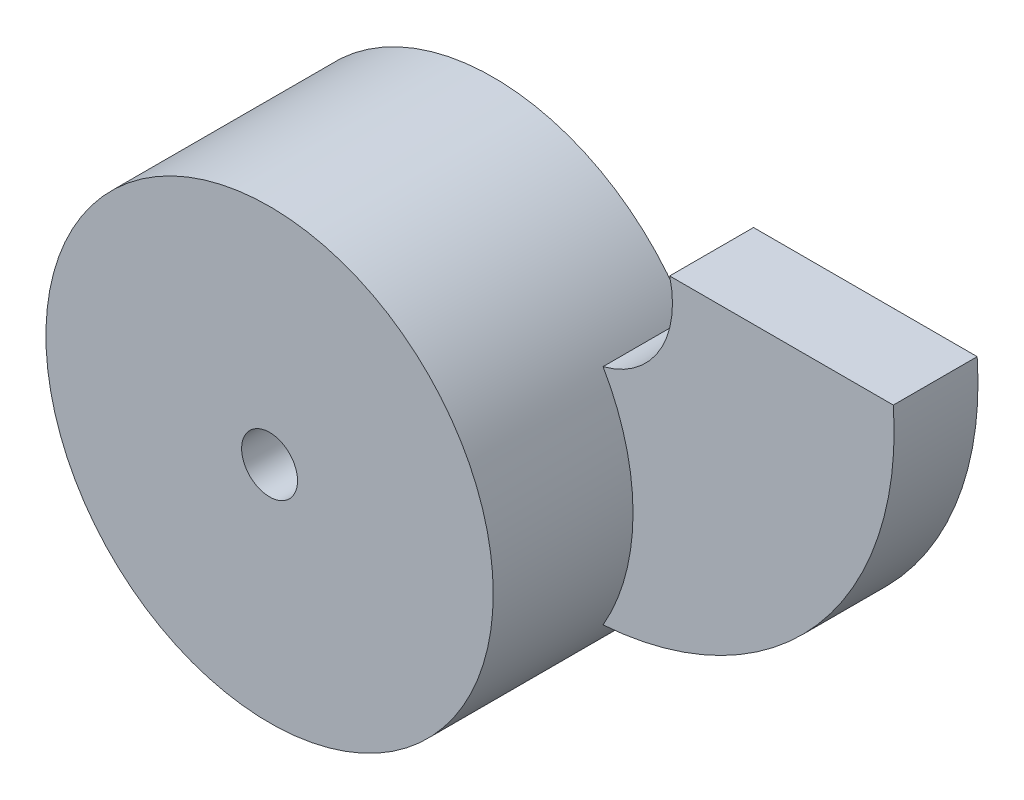
ISO-10303-21;
HEADER;
FILE_DESCRIPTION(('STEP AP214'),'2;1');
FILE_NAME('part.step','',(''),(''),'','','');
FILE_SCHEMA(('AUTOMOTIVE_DESIGN { 1 0 10303 214 1 1 1 1 }'));
ENDSEC;
DATA;
#1=APPLICATION_CONTEXT('core data for automotive mechanical design processes');
#2=APPLICATION_PROTOCOL_DEFINITION('international standard','automotive_design',2000,#1);
#3=PRODUCT_CONTEXT('',#1,'mechanical');
#4=PRODUCT('Part','Part','',(#3));
#5=PRODUCT_RELATED_PRODUCT_CATEGORY('part','',(#4));
#6=PRODUCT_DEFINITION_FORMATION('','',#4);
#7=PRODUCT_DEFINITION_CONTEXT('part definition',#1,'design');
#8=PRODUCT_DEFINITION('design','',#6,#7);
#9=PRODUCT_DEFINITION_SHAPE('','',#8);
#10=(LENGTH_UNIT() NAMED_UNIT(*) SI_UNIT(.MILLI.,.METRE.));
#11=(NAMED_UNIT(*) PLANE_ANGLE_UNIT() SI_UNIT($,.RADIAN.));
#12=(NAMED_UNIT(*) SI_UNIT($,.STERADIAN.) SOLID_ANGLE_UNIT());
#13=UNCERTAINTY_MEASURE_WITH_UNIT(LENGTH_MEASURE(1.E-05),#10,'distance_accuracy_value','');
#14=(GEOMETRIC_REPRESENTATION_CONTEXT(3) GLOBAL_UNCERTAINTY_ASSIGNED_CONTEXT((#13)) GLOBAL_UNIT_ASSIGNED_CONTEXT((#10,
#11,#12)) REPRESENTATION_CONTEXT('',''));
#15=CARTESIAN_POINT('',(0.,0.,0.));
#16=DIRECTION('',(0.,0.,1.));
#17=DIRECTION('',(1.,0.,0.));
#18=AXIS2_PLACEMENT_3D('',#15,#16,#17);
#19=CARTESIAN_POINT('',(-15.9540506372778,-4.04594936272216,15.));
#20=DIRECTION('',(0.,0.,-1.));
#21=DIRECTION('',(-1.,0.,0.));
#22=AXIS2_PLACEMENT_3D('',#19,#20,#21);
#23=PLANE('',#22);
#24=CARTESIAN_POINT('',(-46.5491174259333,-40.,15.));
#25=DIRECTION('',(0.,0.,1.));
#26=DIRECTION('',(1.,0.,0.));
#27=AXIS2_PLACEMENT_3D('',#24,#25,#26);
#28=CIRCLE('',#27,40.);
#29=CARTESIAN_POINT('',(-11.9081012745557,-60.,15.));
#30=VERTEX_POINT('',#29);
#31=CARTESIAN_POINT('',(-11.9081012745557,-20.,15.));
#32=VERTEX_POINT('',#31);
#33=EDGE_CURVE('E12',#30,#32,#28,.T.);
#34=ORIENTED_EDGE('',*,*,#33,.F.);
#35=CARTESIAN_POINT('',(-15.9540506372778,-4.04594936272216,15.));
#36=DIRECTION('',(0.,0.,1.));
#37=DIRECTION('',(-1.,0.,0.));
#38=AXIS2_PLACEMENT_3D('',#35,#36,#37);
#39=CIRCLE('',#38,56.1001380476444);
#40=CARTESIAN_POINT('',(40.,0.,15.));
#41=VERTEX_POINT('',#40);
#42=EDGE_CURVE('E95',#30,#41,#39,.T.);
#43=ORIENTED_EDGE('',*,*,#42,.T.);
#44=DIRECTION('',(-1.,0.,0.));
#45=VECTOR('',#44,1.);
#46=CARTESIAN_POINT('',(0.,0.,15.));
#47=LINE('',#46,#45);
#48=CARTESIAN_POINT('',(0.,0.,15.));
#49=VERTEX_POINT('',#48);
#50=EDGE_CURVE('E57',#41,#49,#47,.T.);
#51=ORIENTED_EDGE('',*,*,#50,.T.);
#52=CARTESIAN_POINT('',(-15.9540506372778,-4.04594936272216,15.));
#53=DIRECTION('',(0.,0.,-1.));
#54=DIRECTION('',(-1.,0.,0.));
#55=AXIS2_PLACEMENT_3D('',#52,#53,#54);
#56=CIRCLE('',#55,16.4590837528259);
#57=EDGE_CURVE('E90',#49,#32,#56,.T.);
#58=ORIENTED_EDGE('',*,*,#57,.T.);
#59=EDGE_LOOP('',(#34,#43,#51,#58));
#60=FACE_BOUND('',#59,.T.);
#61=ADVANCED_FACE('F39',(#60),#23,.F.);
#62=CARTESIAN_POINT('',(-15.9540506372778,-4.04594936272216,0.));
#63=DIRECTION('',(0.,0.,-1.));
#64=DIRECTION('',(-1.,0.,0.));
#65=AXIS2_PLACEMENT_3D('',#62,#63,#64);
#66=PLANE('',#65);
#67=CARTESIAN_POINT('',(-15.9540506372778,-4.04594936272216,0.));
#68=DIRECTION('',(0.,0.,-1.));
#69=DIRECTION('',(-1.,0.,0.));
#70=AXIS2_PLACEMENT_3D('',#67,#68,#69);
#71=CIRCLE('',#70,16.4590837528259);
#72=CARTESIAN_POINT('',(0.,0.,0.));
#73=VERTEX_POINT('',#72);
#74=CARTESIAN_POINT('',(-11.9081012745557,-20.,0.));
#75=VERTEX_POINT('',#74);
#76=EDGE_CURVE('E92',#73,#75,#71,.T.);
#77=ORIENTED_EDGE('',*,*,#76,.F.);
#78=DIRECTION('',(-1.,0.,0.));
#79=VECTOR('',#78,1.);
#80=CARTESIAN_POINT('',(0.,0.,0.));
#81=LINE('',#80,#79);
#82=CARTESIAN_POINT('',(40.,0.,0.));
#83=VERTEX_POINT('',#82);
#84=EDGE_CURVE('E80',#83,#73,#81,.T.);
#85=ORIENTED_EDGE('',*,*,#84,.F.);
#86=CARTESIAN_POINT('',(-15.9540506372778,-4.04594936272216,0.));
#87=DIRECTION('',(0.,0.,1.));
#88=DIRECTION('',(-1.,0.,0.));
#89=AXIS2_PLACEMENT_3D('',#86,#87,#88);
#90=CIRCLE('',#89,56.1001380476444);
#91=CARTESIAN_POINT('',(-11.9081012745557,-60.,0.));
#92=VERTEX_POINT('',#91);
#93=EDGE_CURVE('E75',#92,#83,#90,.T.);
#94=ORIENTED_EDGE('',*,*,#93,.F.);
#95=CARTESIAN_POINT('',(-46.5491174259333,-40.,0.));
#96=DIRECTION('',(0.,0.,1.));
#97=DIRECTION('',(1.,0.,0.));
#98=AXIS2_PLACEMENT_3D('',#95,#96,#97);
#99=CIRCLE('',#98,40.);
#100=EDGE_CURVE('E100',#75,#92,#99,.T.);
#101=ORIENTED_EDGE('',*,*,#100,.F.);
#102=EDGE_LOOP('',(#77,#85,#94,#101));
#103=FACE_BOUND('',#102,.T.);
#104=CARTESIAN_POINT('',(-46.5491174259333,-40.,0.));
#105=DIRECTION('',(0.,0.,1.));
#106=DIRECTION('',(1.,0.,0.));
#107=AXIS2_PLACEMENT_3D('',#104,#105,#106);
#108=CIRCLE('',#107,5.00000000000001);
#109=CARTESIAN_POINT('',(-41.5491174259333,-40.,0.));
#110=VERTEX_POINT('',#109);
#111=EDGE_CURVE('E109',#110,#110,#108,.T.);
#112=ORIENTED_EDGE('',*,*,#111,.T.);
#113=EDGE_LOOP('',(#112));
#114=FACE_BOUND('',#113,.T.);
#115=ADVANCED_FACE('F116',(#103,#114),#66,.T.);
#116=CARTESIAN_POINT('',(-15.9540506372778,-4.04594936272216,15.));
#117=DIRECTION('',(0.,0.,-1.));
#118=DIRECTION('',(-1.,0.,0.));
#119=AXIS2_PLACEMENT_3D('',#116,#117,#118);
#120=CYLINDRICAL_SURFACE('',#119,16.4590837528259);
#121=ORIENTED_EDGE('',*,*,#76,.T.);
#122=DIRECTION('',(0.,0.,-1.));
#123=VECTOR('',#122,1.);
#124=CARTESIAN_POINT('',(-11.9081012745557,-20.,15.));
#125=LINE('',#124,#123);
#126=EDGE_CURVE('E43',#32,#75,#125,.T.);
#127=ORIENTED_EDGE('',*,*,#126,.F.);
#128=ORIENTED_EDGE('',*,*,#57,.F.);
#129=DIRECTION('',(0.,0.,-1.));
#130=VECTOR('',#129,1.);
#131=CARTESIAN_POINT('',(0.,0.,15.));
#132=LINE('',#131,#130);
#133=EDGE_CURVE('E104',#49,#73,#132,.T.);
#134=ORIENTED_EDGE('',*,*,#133,.T.);
#135=EDGE_LOOP('',(#121,#127,#128,#134));
#136=FACE_BOUND('',#135,.T.);
#137=ADVANCED_FACE('F41',(#136),#120,.F.);
#138=CARTESIAN_POINT('',(-46.5491174259333,-40.,15.));
#139=DIRECTION('',(0.,0.,-1.));
#140=DIRECTION('',(-1.,0.,0.));
#141=AXIS2_PLACEMENT_3D('',#138,#139,#140);
#142=CYLINDRICAL_SURFACE('',#141,40.);
#143=ORIENTED_EDGE('',*,*,#100,.T.);
#144=DIRECTION('',(0.,0.,-1.));
#145=VECTOR('',#144,1.);
#146=CARTESIAN_POINT('',(-11.9081012745557,-60.,15.));
#147=LINE('',#146,#145);
#148=EDGE_CURVE('E94',#30,#92,#147,.T.);
#149=ORIENTED_EDGE('',*,*,#148,.F.);
#150=ORIENTED_EDGE('',*,*,#33,.T.);
#151=ORIENTED_EDGE('',*,*,#126,.T.);
#152=EDGE_LOOP('',(#143,#149,#150,#151));
#153=FACE_BOUND('',#152,.T.);
#154=CARTESIAN_POINT('',(-46.5491174259333,-40.,40.));
#155=DIRECTION('',(0.,0.,1.));
#156=DIRECTION('',(1.,0.,0.));
#157=AXIS2_PLACEMENT_3D('',#154,#155,#156);
#158=CIRCLE('',#157,40.);
#159=CARTESIAN_POINT('',(-6.54911742593328,-40.,40.));
#160=VERTEX_POINT('',#159);
#161=EDGE_CURVE('E123',#160,#160,#158,.T.);
#162=ORIENTED_EDGE('',*,*,#161,.F.);
#163=EDGE_LOOP('',(#162));
#164=FACE_BOUND('',#163,.T.);
#165=ADVANCED_FACE('F97',(#153,#164),#142,.T.);
#166=CARTESIAN_POINT('',(-15.9540506372778,-4.04594936272216,15.));
#167=DIRECTION('',(0.,0.,-1.));
#168=DIRECTION('',(-1.,0.,0.));
#169=AXIS2_PLACEMENT_3D('',#166,#167,#168);
#170=CYLINDRICAL_SURFACE('',#169,56.1001380476444);
#171=ORIENTED_EDGE('',*,*,#93,.T.);
#172=DIRECTION('',(0.,0.,-1.));
#173=VECTOR('',#172,1.);
#174=CARTESIAN_POINT('',(40.,0.,15.));
#175=LINE('',#174,#173);
#176=EDGE_CURVE('E101',#41,#83,#175,.T.);
#177=ORIENTED_EDGE('',*,*,#176,.F.);
#178=ORIENTED_EDGE('',*,*,#42,.F.);
#179=ORIENTED_EDGE('',*,*,#148,.T.);
#180=EDGE_LOOP('',(#171,#177,#178,#179));
#181=FACE_BOUND('',#180,.T.);
#182=ADVANCED_FACE('F102',(#181),#170,.T.);
#183=CARTESIAN_POINT('',(0.,0.,15.));
#184=DIRECTION('',(0.,-1.,0.));
#185=DIRECTION('',(1.,0.,0.));
#186=AXIS2_PLACEMENT_3D('',#183,#184,#185);
#187=PLANE('',#186);
#188=ORIENTED_EDGE('',*,*,#84,.T.);
#189=ORIENTED_EDGE('',*,*,#133,.F.);
#190=ORIENTED_EDGE('',*,*,#50,.F.);
#191=ORIENTED_EDGE('',*,*,#176,.T.);
#192=EDGE_LOOP('',(#188,#189,#190,#191));
#193=FACE_BOUND('',#192,.T.);
#194=ADVANCED_FACE('F114',(#193),#187,.F.);
#195=CARTESIAN_POINT('',(-46.5491174259333,-40.,15.));
#196=DIRECTION('',(0.,0.,-1.));
#197=DIRECTION('',(-1.,0.,0.));
#198=AXIS2_PLACEMENT_3D('',#195,#196,#197);
#199=CYLINDRICAL_SURFACE('',#198,5.00000000000001);
#200=ORIENTED_EDGE('',*,*,#111,.F.);
#201=EDGE_LOOP('',(#200));
#202=FACE_BOUND('',#201,.T.);
#203=CARTESIAN_POINT('',(-46.5491174259333,-40.,40.));
#204=DIRECTION('',(0.,0.,1.));
#205=DIRECTION('',(1.,0.,0.));
#206=AXIS2_PLACEMENT_3D('',#203,#204,#205);
#207=CIRCLE('',#206,5.00000000000001);
#208=CARTESIAN_POINT('',(-41.5491174259333,-40.,40.));
#209=VERTEX_POINT('',#208);
#210=EDGE_CURVE('E125',#209,#209,#207,.T.);
#211=ORIENTED_EDGE('',*,*,#210,.T.);
#212=EDGE_LOOP('',(#211));
#213=FACE_BOUND('',#212,.T.);
#214=ADVANCED_FACE('F131',(#202,#213),#199,.F.);
#215=CARTESIAN_POINT('',(-46.5491174259333,-40.,40.));
#216=DIRECTION('',(0.,0.,1.));
#217=DIRECTION('',(1.,0.,0.));
#218=AXIS2_PLACEMENT_3D('',#215,#216,#217);
#219=PLANE('',#218);
#220=ORIENTED_EDGE('',*,*,#161,.T.);
#221=EDGE_LOOP('',(#220));
#222=FACE_BOUND('',#221,.T.);
#223=ORIENTED_EDGE('',*,*,#210,.F.);
#224=EDGE_LOOP('',(#223));
#225=FACE_BOUND('',#224,.T.);
#226=ADVANCED_FACE('F133',(#222,#225),#219,.T.);
#227=CLOSED_SHELL('',(#61,#115,#137,#165,#182,#194,#214,#226));
#228=MANIFOLD_SOLID_BREP('B2',#227);
#229=ADVANCED_BREP_SHAPE_REPRESENTATION('',(#18,#228),#14);
#230=SHAPE_DEFINITION_REPRESENTATION(#9,#229);
ENDSEC;
END-ISO-10303-21;
